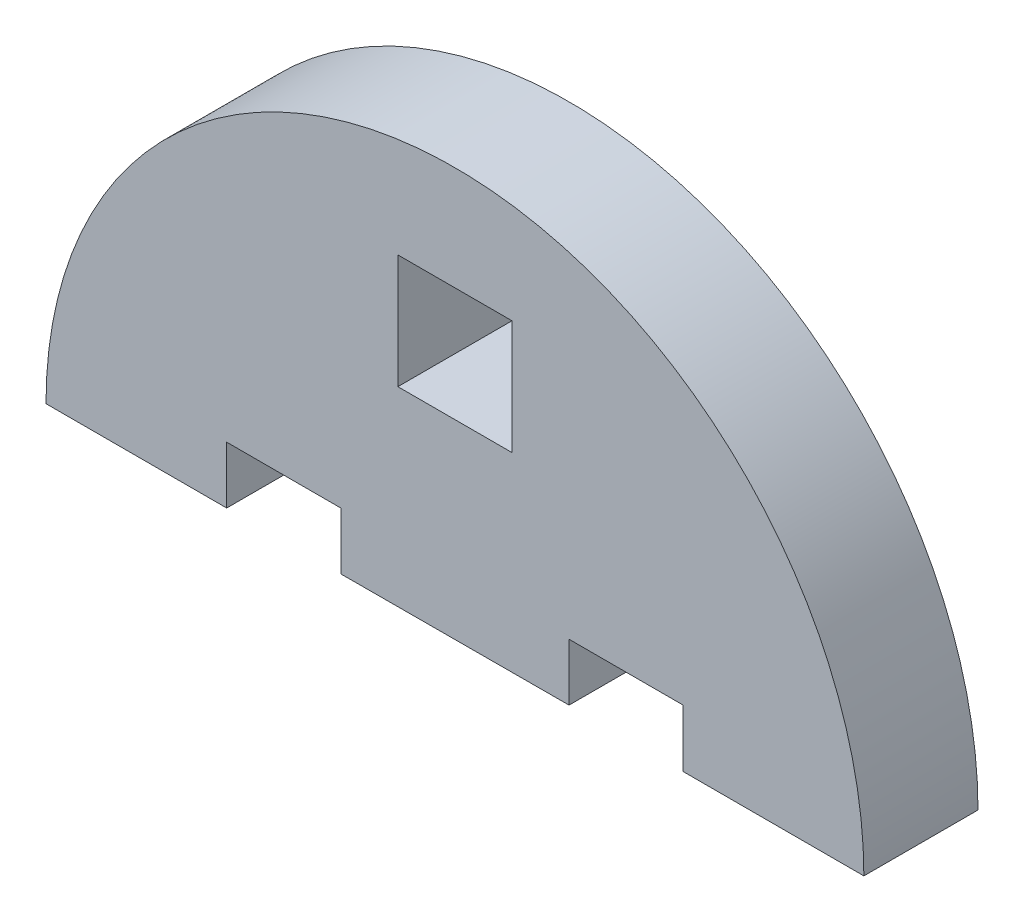
ISO-10303-21;
HEADER;
FILE_DESCRIPTION(('STEP AP214'),'2;1');
FILE_NAME('part.step','',(''),(''),'','','');
FILE_SCHEMA(('AUTOMOTIVE_DESIGN { 1 0 10303 214 1 1 1 1 }'));
ENDSEC;
DATA;
#1=APPLICATION_CONTEXT('core data for automotive mechanical design processes');
#2=APPLICATION_PROTOCOL_DEFINITION('international standard','automotive_design',2000,#1);
#3=PRODUCT_CONTEXT('',#1,'mechanical');
#4=PRODUCT('Part','Part','',(#3));
#5=PRODUCT_RELATED_PRODUCT_CATEGORY('part','',(#4));
#6=PRODUCT_DEFINITION_FORMATION('','',#4);
#7=PRODUCT_DEFINITION_CONTEXT('part definition',#1,'design');
#8=PRODUCT_DEFINITION('design','',#6,#7);
#9=PRODUCT_DEFINITION_SHAPE('','',#8);
#10=(LENGTH_UNIT() NAMED_UNIT(*) SI_UNIT(.MILLI.,.METRE.));
#11=(NAMED_UNIT(*) PLANE_ANGLE_UNIT() SI_UNIT($,.RADIAN.));
#12=(NAMED_UNIT(*) SI_UNIT($,.STERADIAN.) SOLID_ANGLE_UNIT());
#13=UNCERTAINTY_MEASURE_WITH_UNIT(LENGTH_MEASURE(1.E-05),#10,'distance_accuracy_value','');
#14=(GEOMETRIC_REPRESENTATION_CONTEXT(3) GLOBAL_UNCERTAINTY_ASSIGNED_CONTEXT((#13)) GLOBAL_UNIT_ASSIGNED_CONTEXT((#10,
#11,#12)) REPRESENTATION_CONTEXT('',''));
#15=CARTESIAN_POINT('',(0.,0.,0.));
#16=DIRECTION('',(0.,0.,1.));
#17=DIRECTION('',(1.,0.,0.));
#18=AXIS2_PLACEMENT_3D('',#15,#16,#17);
#19=CARTESIAN_POINT('',(3904.03165644461,1073.4878930967,6.));
#20=DIRECTION('',(0.,0.,1.));
#21=DIRECTION('',(1.,0.,0.));
#22=AXIS2_PLACEMENT_3D('',#19,#20,#21);
#23=PLANE('',#22);
#24=DIRECTION('',(-1.,0.,0.));
#25=VECTOR('',#24,1.);
#26=CARTESIAN_POINT('',(3925.5316564446,1073.4878930967,6.));
#27=LINE('',#26,#25);
#28=CARTESIAN_POINT('',(3925.5316564446,1073.4878930967,6.));
#29=VERTEX_POINT('',#28);
#30=CARTESIAN_POINT('',(3916.03165644461,1073.4878930967,6.));
#31=VERTEX_POINT('',#30);
#32=EDGE_CURVE('E232',#29,#31,#27,.T.);
#33=ORIENTED_EDGE('',*,*,#32,.F.);
#34=CARTESIAN_POINT('',(3904.03165644461,1073.4878930967,6.));
#35=DIRECTION('',(0.,0.,1.));
#36=DIRECTION('',(1.,0.,0.));
#37=AXIS2_PLACEMENT_3D('',#34,#35,#36);
#38=CIRCLE('',#37,21.499999999989);
#39=CARTESIAN_POINT('',(3882.53165644463,1073.4878930967,6.));
#40=VERTEX_POINT('',#39);
#41=EDGE_CURVE('E262',#29,#40,#38,.T.);
#42=ORIENTED_EDGE('',*,*,#41,.T.);
#43=DIRECTION('',(-1.,0.,0.));
#44=VECTOR('',#43,1.);
#45=CARTESIAN_POINT('',(3892.03165644461,1073.4878930967,6.));
#46=LINE('',#45,#44);
#47=CARTESIAN_POINT('',(3892.03165644461,1073.4878930967,6.));
#48=VERTEX_POINT('',#47);
#49=EDGE_CURVE('E258',#48,#40,#46,.T.);
#50=ORIENTED_EDGE('',*,*,#49,.F.);
#51=DIRECTION('',(0.,1.,0.));
#52=VECTOR('',#51,1.);
#53=CARTESIAN_POINT('',(3892.03165644461,1073.4878930967,6.));
#54=LINE('',#53,#52);
#55=CARTESIAN_POINT('',(3892.03165644461,1076.4878930967,6.));
#56=VERTEX_POINT('',#55);
#57=EDGE_CURVE('E255',#48,#56,#54,.T.);
#58=ORIENTED_EDGE('',*,*,#57,.T.);
#59=DIRECTION('',(1.,0.,0.));
#60=VECTOR('',#59,1.);
#61=CARTESIAN_POINT('',(3892.03165644461,1076.4878930967,6.));
#62=LINE('',#61,#60);
#63=CARTESIAN_POINT('',(3898.03165644461,1076.4878930967,6.));
#64=VERTEX_POINT('',#63);
#65=EDGE_CURVE('E252',#56,#64,#62,.T.);
#66=ORIENTED_EDGE('',*,*,#65,.T.);
#67=DIRECTION('',(0.,-1.,0.));
#68=VECTOR('',#67,1.);
#69=CARTESIAN_POINT('',(3898.03165644461,1076.4878930967,6.));
#70=LINE('',#69,#68);
#71=CARTESIAN_POINT('',(3898.03165644461,1073.4878930967,6.));
#72=VERTEX_POINT('',#71);
#73=EDGE_CURVE('E249',#64,#72,#70,.T.);
#74=ORIENTED_EDGE('',*,*,#73,.T.);
#75=DIRECTION('',(0.99999765231312,0.00216687984161648,0.));
#76=VECTOR('',#75,1.);
#77=CARTESIAN_POINT('',(3898.03165644461,1073.4878930967,6.));
#78=LINE('',#77,#76);
#79=CARTESIAN_POINT('',(3910.0316001002,1073.51389559376,6.));
#80=VERTEX_POINT('',#79);
#81=EDGE_CURVE('E246',#72,#80,#78,.T.);
#82=ORIENTED_EDGE('',*,*,#81,.T.);
#83=DIRECTION('',(0.,1.,0.));
#84=VECTOR('',#83,1.);
#85=CARTESIAN_POINT('',(3910.0316001002,1073.51389559376,6.));
#86=LINE('',#85,#84);
#87=CARTESIAN_POINT('',(3910.0316001002,1076.51389559376,6.));
#88=VERTEX_POINT('',#87);
#89=EDGE_CURVE('E243',#80,#88,#86,.T.);
#90=ORIENTED_EDGE('',*,*,#89,.T.);
#91=DIRECTION('',(1.,0.,0.));
#92=VECTOR('',#91,1.);
#93=CARTESIAN_POINT('',(3910.0316001002,1076.51389559376,6.));
#94=LINE('',#93,#92);
#95=CARTESIAN_POINT('',(3916.0316001002,1076.51389559376,6.));
#96=VERTEX_POINT('',#95);
#97=EDGE_CURVE('E240',#88,#96,#94,.T.);
#98=ORIENTED_EDGE('',*,*,#97,.T.);
#99=DIRECTION('',(1.86200834115068E-05,-0.999999999826646,0.));
#100=VECTOR('',#99,1.);
#101=CARTESIAN_POINT('',(3916.0316001002,1076.51389559376,6.));
#102=LINE('',#101,#100);
#103=EDGE_CURVE('E236',#96,#31,#102,.T.);
#104=ORIENTED_EDGE('',*,*,#103,.T.);
#105=EDGE_LOOP('',(#33,#42,#50,#58,#66,#74,#82,#90,#98,#104));
#106=FACE_BOUND('',#105,.T.);
#107=DIRECTION('',(0.,1.,0.));
#108=VECTOR('',#107,1.);
#109=CARTESIAN_POINT('',(3907.0316001002,0.,6.));
#110=LINE('',#109,#108);
#111=CARTESIAN_POINT('',(3907.0316001002,1083.51389559376,6.));
#112=VERTEX_POINT('',#111);
#113=CARTESIAN_POINT('',(3907.0316001002,1089.51389559376,6.));
#114=VERTEX_POINT('',#113);
#115=EDGE_CURVE('E193',#112,#114,#110,.T.);
#116=ORIENTED_EDGE('',*,*,#115,.F.);
#117=DIRECTION('',(1.,0.,0.));
#118=VECTOR('',#117,1.);
#119=CARTESIAN_POINT('',(0.,1083.51389559376,6.));
#120=LINE('',#119,#118);
#121=CARTESIAN_POINT('',(3901.0316001002,1083.51389559376,6.));
#122=VERTEX_POINT('',#121);
#123=EDGE_CURVE('E184',#122,#112,#120,.T.);
#124=ORIENTED_EDGE('',*,*,#123,.F.);
#125=DIRECTION('',(0.,-1.,0.));
#126=VECTOR('',#125,1.);
#127=CARTESIAN_POINT('',(3901.0316001002,0.,6.));
#128=LINE('',#127,#126);
#129=CARTESIAN_POINT('',(3901.0316001002,1089.51389559376,6.));
#130=VERTEX_POINT('',#129);
#131=EDGE_CURVE('E210',#130,#122,#128,.T.);
#132=ORIENTED_EDGE('',*,*,#131,.F.);
#133=DIRECTION('',(-1.,0.,0.));
#134=VECTOR('',#133,1.);
#135=CARTESIAN_POINT('',(0.,1089.51389559376,6.));
#136=LINE('',#135,#134);
#137=EDGE_CURVE('E206',#114,#130,#136,.T.);
#138=ORIENTED_EDGE('',*,*,#137,.F.);
#139=EDGE_LOOP('',(#116,#124,#132,#138));
#140=FACE_BOUND('',#139,.T.);
#141=ADVANCED_FACE('F81',(#106,#140),#23,.T.);
#142=CARTESIAN_POINT('',(3904.03165644461,1073.4878930967,0.));
#143=DIRECTION('',(0.,0.,1.));
#144=DIRECTION('',(1.,0.,0.));
#145=AXIS2_PLACEMENT_3D('',#142,#143,#144);
#146=PLANE('',#145);
#147=DIRECTION('',(-1.,0.,0.));
#148=VECTOR('',#147,1.);
#149=CARTESIAN_POINT('',(3925.5316564446,1073.4878930967,0.));
#150=LINE('',#149,#148);
#151=CARTESIAN_POINT('',(3925.5316564446,1073.4878930967,0.));
#152=VERTEX_POINT('',#151);
#153=CARTESIAN_POINT('',(3916.03165644461,1073.4878930967,0.));
#154=VERTEX_POINT('',#153);
#155=EDGE_CURVE('E202',#152,#154,#150,.T.);
#156=ORIENTED_EDGE('',*,*,#155,.T.);
#157=DIRECTION('',(1.86200834115068E-05,-0.999999999826646,0.));
#158=VECTOR('',#157,1.);
#159=CARTESIAN_POINT('',(3916.0316001002,1076.51389559376,0.));
#160=LINE('',#159,#158);
#161=CARTESIAN_POINT('',(3916.0316001002,1076.51389559376,0.));
#162=VERTEX_POINT('',#161);
#163=EDGE_CURVE('E268',#162,#154,#160,.T.);
#164=ORIENTED_EDGE('',*,*,#163,.F.);
#165=DIRECTION('',(1.,0.,0.));
#166=VECTOR('',#165,1.);
#167=CARTESIAN_POINT('',(3910.0316001002,1076.51389559376,0.));
#168=LINE('',#167,#166);
#169=CARTESIAN_POINT('',(3910.0316001002,1076.51389559376,0.));
#170=VERTEX_POINT('',#169);
#171=EDGE_CURVE('E272',#170,#162,#168,.T.);
#172=ORIENTED_EDGE('',*,*,#171,.F.);
#173=DIRECTION('',(0.,1.,0.));
#174=VECTOR('',#173,1.);
#175=CARTESIAN_POINT('',(3910.0316001002,1073.51389559376,0.));
#176=LINE('',#175,#174);
#177=CARTESIAN_POINT('',(3910.0316001002,1073.51389559376,0.));
#178=VERTEX_POINT('',#177);
#179=EDGE_CURVE('E275',#178,#170,#176,.T.);
#180=ORIENTED_EDGE('',*,*,#179,.F.);
#181=DIRECTION('',(0.99999765231312,0.00216687984161648,0.));
#182=VECTOR('',#181,1.);
#183=CARTESIAN_POINT('',(3898.03165644461,1073.4878930967,0.));
#184=LINE('',#183,#182);
#185=CARTESIAN_POINT('',(3898.03165644461,1073.4878930967,0.));
#186=VERTEX_POINT('',#185);
#187=EDGE_CURVE('E278',#186,#178,#184,.T.);
#188=ORIENTED_EDGE('',*,*,#187,.F.);
#189=DIRECTION('',(0.,-1.,0.));
#190=VECTOR('',#189,1.);
#191=CARTESIAN_POINT('',(3898.03165644461,1076.4878930967,0.));
#192=LINE('',#191,#190);
#193=CARTESIAN_POINT('',(3898.03165644461,1076.4878930967,0.));
#194=VERTEX_POINT('',#193);
#195=EDGE_CURVE('E281',#194,#186,#192,.T.);
#196=ORIENTED_EDGE('',*,*,#195,.F.);
#197=DIRECTION('',(1.,0.,0.));
#198=VECTOR('',#197,1.);
#199=CARTESIAN_POINT('',(3892.03165644461,1076.4878930967,0.));
#200=LINE('',#199,#198);
#201=CARTESIAN_POINT('',(3892.03165644461,1076.4878930967,0.));
#202=VERTEX_POINT('',#201);
#203=EDGE_CURVE('E284',#202,#194,#200,.T.);
#204=ORIENTED_EDGE('',*,*,#203,.F.);
#205=DIRECTION('',(0.,1.,0.));
#206=VECTOR('',#205,1.);
#207=CARTESIAN_POINT('',(3892.03165644461,1073.4878930967,0.));
#208=LINE('',#207,#206);
#209=CARTESIAN_POINT('',(3892.03165644461,1073.4878930967,0.));
#210=VERTEX_POINT('',#209);
#211=EDGE_CURVE('E287',#210,#202,#208,.T.);
#212=ORIENTED_EDGE('',*,*,#211,.F.);
#213=DIRECTION('',(-1.,0.,0.));
#214=VECTOR('',#213,1.);
#215=CARTESIAN_POINT('',(3892.03165644461,1073.4878930967,0.));
#216=LINE('',#215,#214);
#217=CARTESIAN_POINT('',(3882.53165644463,1073.4878930967,0.));
#218=VERTEX_POINT('',#217);
#219=EDGE_CURVE('E290',#210,#218,#216,.T.);
#220=ORIENTED_EDGE('',*,*,#219,.T.);
#221=CARTESIAN_POINT('',(3904.03165644461,1073.4878930967,0.));
#222=DIRECTION('',(0.,0.,1.));
#223=DIRECTION('',(1.,0.,0.));
#224=AXIS2_PLACEMENT_3D('',#221,#222,#223);
#225=CIRCLE('',#224,21.499999999989);
#226=EDGE_CURVE('E237',#152,#218,#225,.T.);
#227=ORIENTED_EDGE('',*,*,#226,.F.);
#228=EDGE_LOOP('',(#156,#164,#172,#180,#188,#196,#204,#212,#220,#227));
#229=FACE_BOUND('',#228,.T.);
#230=DIRECTION('',(1.,0.,0.));
#231=VECTOR('',#230,1.);
#232=CARTESIAN_POINT('',(0.,1083.51389559376,0.));
#233=LINE('',#232,#231);
#234=CARTESIAN_POINT('',(3901.0316001002,1083.51389559376,0.));
#235=VERTEX_POINT('',#234);
#236=CARTESIAN_POINT('',(3907.0316001002,1083.51389559376,0.));
#237=VERTEX_POINT('',#236);
#238=EDGE_CURVE('E107',#235,#237,#233,.T.);
#239=ORIENTED_EDGE('',*,*,#238,.T.);
#240=DIRECTION('',(0.,1.,0.));
#241=VECTOR('',#240,1.);
#242=CARTESIAN_POINT('',(3907.0316001002,0.,0.));
#243=LINE('',#242,#241);
#244=CARTESIAN_POINT('',(3907.0316001002,1089.51389559376,0.));
#245=VERTEX_POINT('',#244);
#246=EDGE_CURVE('E200',#237,#245,#243,.T.);
#247=ORIENTED_EDGE('',*,*,#246,.T.);
#248=DIRECTION('',(-1.,0.,0.));
#249=VECTOR('',#248,1.);
#250=CARTESIAN_POINT('',(0.,1089.51389559376,0.));
#251=LINE('',#250,#249);
#252=CARTESIAN_POINT('',(3901.0316001002,1089.51389559376,0.));
#253=VERTEX_POINT('',#252);
#254=EDGE_CURVE('E219',#245,#253,#251,.T.);
#255=ORIENTED_EDGE('',*,*,#254,.T.);
#256=DIRECTION('',(0.,-1.,0.));
#257=VECTOR('',#256,1.);
#258=CARTESIAN_POINT('',(3901.0316001002,0.,0.));
#259=LINE('',#258,#257);
#260=EDGE_CURVE('E194',#253,#235,#259,.T.);
#261=ORIENTED_EDGE('',*,*,#260,.T.);
#262=EDGE_LOOP('',(#239,#247,#255,#261));
#263=FACE_BOUND('',#262,.T.);
#264=ADVANCED_FACE('F337',(#229,#263),#146,.F.);
#265=CARTESIAN_POINT('',(3925.5316564446,1073.4878930967,6.));
#266=DIRECTION('',(0.,-1.,0.));
#267=DIRECTION('',(1.,0.,0.));
#268=AXIS2_PLACEMENT_3D('',#265,#266,#267);
#269=PLANE('',#268);
#270=ORIENTED_EDGE('',*,*,#155,.F.);
#271=DIRECTION('',(0.,0.,-1.));
#272=VECTOR('',#271,1.);
#273=CARTESIAN_POINT('',(3925.5316564446,1073.4878930967,6.));
#274=LINE('',#273,#272);
#275=EDGE_CURVE('E12',#29,#152,#274,.T.);
#276=ORIENTED_EDGE('',*,*,#275,.F.);
#277=ORIENTED_EDGE('',*,*,#32,.T.);
#278=DIRECTION('',(0.,0.,-1.));
#279=VECTOR('',#278,1.);
#280=CARTESIAN_POINT('',(3916.03165644461,1073.4878930967,6.));
#281=LINE('',#280,#279);
#282=EDGE_CURVE('E85',#31,#154,#281,.T.);
#283=ORIENTED_EDGE('',*,*,#282,.T.);
#284=EDGE_LOOP('',(#270,#276,#277,#283));
#285=FACE_BOUND('',#284,.T.);
#286=ADVANCED_FACE('F83',(#285),#269,.T.);
#287=CARTESIAN_POINT('',(3904.03165644461,1073.4878930967,6.));
#288=DIRECTION('',(0.,0.,-1.));
#289=DIRECTION('',(-1.,0.,0.));
#290=AXIS2_PLACEMENT_3D('',#287,#288,#289);
#291=CYLINDRICAL_SURFACE('',#290,21.499999999989);
#292=ORIENTED_EDGE('',*,*,#226,.T.);
#293=DIRECTION('',(0.,0.,-1.));
#294=VECTOR('',#293,1.);
#295=CARTESIAN_POINT('',(3882.53165644463,1073.4878930967,6.));
#296=LINE('',#295,#294);
#297=EDGE_CURVE('E91',#40,#218,#296,.T.);
#298=ORIENTED_EDGE('',*,*,#297,.F.);
#299=ORIENTED_EDGE('',*,*,#41,.F.);
#300=ORIENTED_EDGE('',*,*,#275,.T.);
#301=EDGE_LOOP('',(#292,#298,#299,#300));
#302=FACE_BOUND('',#301,.T.);
#303=ADVANCED_FACE('F343',(#302),#291,.T.);
#304=CARTESIAN_POINT('',(3892.03165644461,1073.4878930967,6.));
#305=DIRECTION('',(0.,-1.,0.));
#306=DIRECTION('',(0.,0.,-1.));
#307=AXIS2_PLACEMENT_3D('',#304,#305,#306);
#308=PLANE('',#307);
#309=ORIENTED_EDGE('',*,*,#219,.F.);
#310=DIRECTION('',(0.,0.,-1.));
#311=VECTOR('',#310,1.);
#312=CARTESIAN_POINT('',(3892.03165644461,1073.4878930967,6.));
#313=LINE('',#312,#311);
#314=EDGE_CURVE('E299',#48,#210,#313,.T.);
#315=ORIENTED_EDGE('',*,*,#314,.F.);
#316=ORIENTED_EDGE('',*,*,#49,.T.);
#317=ORIENTED_EDGE('',*,*,#297,.T.);
#318=EDGE_LOOP('',(#309,#315,#316,#317));
#319=FACE_BOUND('',#318,.T.);
#320=ADVANCED_FACE('F375',(#319),#308,.T.);
#321=CARTESIAN_POINT('',(3892.03165644461,1073.4878930967,6.));
#322=DIRECTION('',(-1.,0.,0.));
#323=DIRECTION('',(0.,0.,1.));
#324=AXIS2_PLACEMENT_3D('',#321,#322,#323);
#325=PLANE('',#324);
#326=ORIENTED_EDGE('',*,*,#211,.T.);
#327=DIRECTION('',(0.,0.,-1.));
#328=VECTOR('',#327,1.);
#329=CARTESIAN_POINT('',(3892.03165644461,1076.4878930967,6.));
#330=LINE('',#329,#328);
#331=EDGE_CURVE('E302',#56,#202,#330,.T.);
#332=ORIENTED_EDGE('',*,*,#331,.F.);
#333=ORIENTED_EDGE('',*,*,#57,.F.);
#334=ORIENTED_EDGE('',*,*,#314,.T.);
#335=EDGE_LOOP('',(#326,#332,#333,#334));
#336=FACE_BOUND('',#335,.T.);
#337=ADVANCED_FACE('F373',(#336),#325,.F.);
#338=CARTESIAN_POINT('',(3892.03165644461,1076.4878930967,6.));
#339=DIRECTION('',(0.,1.,0.));
#340=DIRECTION('',(0.,0.,1.));
#341=AXIS2_PLACEMENT_3D('',#338,#339,#340);
#342=PLANE('',#341);
#343=ORIENTED_EDGE('',*,*,#203,.T.);
#344=DIRECTION('',(0.,0.,-1.));
#345=VECTOR('',#344,1.);
#346=CARTESIAN_POINT('',(3898.03165644461,1076.4878930967,6.));
#347=LINE('',#346,#345);
#348=EDGE_CURVE('E306',#64,#194,#347,.T.);
#349=ORIENTED_EDGE('',*,*,#348,.F.);
#350=ORIENTED_EDGE('',*,*,#65,.F.);
#351=ORIENTED_EDGE('',*,*,#331,.T.);
#352=EDGE_LOOP('',(#343,#349,#350,#351));
#353=FACE_BOUND('',#352,.T.);
#354=ADVANCED_FACE('F368',(#353),#342,.F.);
#355=CARTESIAN_POINT('',(3898.03165644461,1076.4878930967,6.));
#356=DIRECTION('',(1.,0.,0.));
#357=DIRECTION('',(0.,0.,-1.));
#358=AXIS2_PLACEMENT_3D('',#355,#356,#357);
#359=PLANE('',#358);
#360=ORIENTED_EDGE('',*,*,#195,.T.);
#361=DIRECTION('',(0.,0.,-1.));
#362=VECTOR('',#361,1.);
#363=CARTESIAN_POINT('',(3898.03165644461,1073.4878930967,6.));
#364=LINE('',#363,#362);
#365=EDGE_CURVE('E310',#72,#186,#364,.T.);
#366=ORIENTED_EDGE('',*,*,#365,.F.);
#367=ORIENTED_EDGE('',*,*,#73,.F.);
#368=ORIENTED_EDGE('',*,*,#348,.T.);
#369=EDGE_LOOP('',(#360,#366,#367,#368));
#370=FACE_BOUND('',#369,.T.);
#371=ADVANCED_FACE('F364',(#370),#359,.F.);
#372=CARTESIAN_POINT('',(3898.03165644461,1073.4878930967,6.));
#373=DIRECTION('',(-0.00216687984161648,0.99999765231312,0.));
#374=DIRECTION('',(-0.99999765231312,-0.00216687984161648,0.));
#375=AXIS2_PLACEMENT_3D('',#372,#373,#374);
#376=PLANE('',#375);
#377=ORIENTED_EDGE('',*,*,#187,.T.);
#378=DIRECTION('',(0.,0.,-1.));
#379=VECTOR('',#378,1.);
#380=CARTESIAN_POINT('',(3910.0316001002,1073.51389559376,6.));
#381=LINE('',#380,#379);
#382=EDGE_CURVE('E314',#80,#178,#381,.T.);
#383=ORIENTED_EDGE('',*,*,#382,.F.);
#384=ORIENTED_EDGE('',*,*,#81,.F.);
#385=ORIENTED_EDGE('',*,*,#365,.T.);
#386=EDGE_LOOP('',(#377,#383,#384,#385));
#387=FACE_BOUND('',#386,.T.);
#388=ADVANCED_FACE('F360',(#387),#376,.F.);
#389=CARTESIAN_POINT('',(3910.0316001002,1073.51389559376,6.));
#390=DIRECTION('',(-1.,0.,0.));
#391=DIRECTION('',(0.,0.,1.));
#392=AXIS2_PLACEMENT_3D('',#389,#390,#391);
#393=PLANE('',#392);
#394=ORIENTED_EDGE('',*,*,#179,.T.);
#395=DIRECTION('',(0.,0.,-1.));
#396=VECTOR('',#395,1.);
#397=CARTESIAN_POINT('',(3910.0316001002,1076.51389559376,6.));
#398=LINE('',#397,#396);
#399=EDGE_CURVE('E318',#88,#170,#398,.T.);
#400=ORIENTED_EDGE('',*,*,#399,.F.);
#401=ORIENTED_EDGE('',*,*,#89,.F.);
#402=ORIENTED_EDGE('',*,*,#382,.T.);
#403=EDGE_LOOP('',(#394,#400,#401,#402));
#404=FACE_BOUND('',#403,.T.);
#405=ADVANCED_FACE('F356',(#404),#393,.F.);
#406=CARTESIAN_POINT('',(3910.0316001002,1076.51389559376,6.));
#407=DIRECTION('',(0.,1.,0.));
#408=DIRECTION('',(0.,0.,1.));
#409=AXIS2_PLACEMENT_3D('',#406,#407,#408);
#410=PLANE('',#409);
#411=ORIENTED_EDGE('',*,*,#171,.T.);
#412=DIRECTION('',(0.,0.,-1.));
#413=VECTOR('',#412,1.);
#414=CARTESIAN_POINT('',(3916.0316001002,1076.51389559376,6.));
#415=LINE('',#414,#413);
#416=EDGE_CURVE('E321',#96,#162,#415,.T.);
#417=ORIENTED_EDGE('',*,*,#416,.F.);
#418=ORIENTED_EDGE('',*,*,#97,.F.);
#419=ORIENTED_EDGE('',*,*,#399,.T.);
#420=EDGE_LOOP('',(#411,#417,#418,#419));
#421=FACE_BOUND('',#420,.T.);
#422=ADVANCED_FACE('F351',(#421),#410,.F.);
#423=CARTESIAN_POINT('',(3916.0316001002,1076.51389559376,6.));
#424=DIRECTION('',(0.999999999826646,1.86200834115068E-05,0.));
#425=DIRECTION('',(-1.86200834115068E-05,0.999999999826646,0.));
#426=AXIS2_PLACEMENT_3D('',#423,#424,#425);
#427=PLANE('',#426);
#428=ORIENTED_EDGE('',*,*,#163,.T.);
#429=ORIENTED_EDGE('',*,*,#282,.F.);
#430=ORIENTED_EDGE('',*,*,#103,.F.);
#431=ORIENTED_EDGE('',*,*,#416,.T.);
#432=EDGE_LOOP('',(#428,#429,#430,#431));
#433=FACE_BOUND('',#432,.T.);
#434=ADVANCED_FACE('F333',(#433),#427,.F.);
#435=CARTESIAN_POINT('',(0.,1083.51389559376,6.));
#436=DIRECTION('',(0.,1.,0.));
#437=DIRECTION('',(0.,0.,1.));
#438=AXIS2_PLACEMENT_3D('',#435,#436,#437);
#439=PLANE('',#438);
#440=ORIENTED_EDGE('',*,*,#238,.F.);
#441=DIRECTION('',(0.,0.,-1.));
#442=VECTOR('',#441,1.);
#443=CARTESIAN_POINT('',(3901.0316001002,1083.51389559376,6.));
#444=LINE('',#443,#442);
#445=EDGE_CURVE('E188',#122,#235,#444,.T.);
#446=ORIENTED_EDGE('',*,*,#445,.F.);
#447=ORIENTED_EDGE('',*,*,#123,.T.);
#448=DIRECTION('',(0.,0.,-1.));
#449=VECTOR('',#448,1.);
#450=CARTESIAN_POINT('',(3907.0316001002,1083.51389559376,6.));
#451=LINE('',#450,#449);
#452=EDGE_CURVE('E187',#112,#237,#451,.T.);
#453=ORIENTED_EDGE('',*,*,#452,.T.);
#454=EDGE_LOOP('',(#440,#446,#447,#453));
#455=FACE_BOUND('',#454,.T.);
#456=ADVANCED_FACE('F186',(#455),#439,.T.);
#457=CARTESIAN_POINT('',(3907.0316001002,0.,6.));
#458=DIRECTION('',(-1.,0.,0.));
#459=DIRECTION('',(0.,0.,1.));
#460=AXIS2_PLACEMENT_3D('',#457,#458,#459);
#461=PLANE('',#460);
#462=ORIENTED_EDGE('',*,*,#246,.F.);
#463=ORIENTED_EDGE('',*,*,#452,.F.);
#464=ORIENTED_EDGE('',*,*,#115,.T.);
#465=DIRECTION('',(0.,0.,-1.));
#466=VECTOR('',#465,1.);
#467=CARTESIAN_POINT('',(3907.0316001002,1089.51389559376,6.));
#468=LINE('',#467,#466);
#469=EDGE_CURVE('E203',#114,#245,#468,.T.);
#470=ORIENTED_EDGE('',*,*,#469,.T.);
#471=EDGE_LOOP('',(#462,#463,#464,#470));
#472=FACE_BOUND('',#471,.T.);
#473=ADVANCED_FACE('F197',(#472),#461,.T.);
#474=CARTESIAN_POINT('',(0.,1089.51389559376,6.));
#475=DIRECTION('',(0.,-1.,0.));
#476=DIRECTION('',(0.,0.,-1.));
#477=AXIS2_PLACEMENT_3D('',#474,#475,#476);
#478=PLANE('',#477);
#479=ORIENTED_EDGE('',*,*,#254,.F.);
#480=ORIENTED_EDGE('',*,*,#469,.F.);
#481=ORIENTED_EDGE('',*,*,#137,.T.);
#482=DIRECTION('',(0.,0.,-1.));
#483=VECTOR('',#482,1.);
#484=CARTESIAN_POINT('',(3901.0316001002,1089.51389559376,6.));
#485=LINE('',#484,#483);
#486=EDGE_CURVE('E99',#130,#253,#485,.T.);
#487=ORIENTED_EDGE('',*,*,#486,.T.);
#488=EDGE_LOOP('',(#479,#480,#481,#487));
#489=FACE_BOUND('',#488,.T.);
#490=ADVANCED_FACE('F395',(#489),#478,.T.);
#491=CARTESIAN_POINT('',(3901.0316001002,0.,6.));
#492=DIRECTION('',(1.,0.,0.));
#493=DIRECTION('',(0.,0.,-1.));
#494=AXIS2_PLACEMENT_3D('',#491,#492,#493);
#495=PLANE('',#494);
#496=ORIENTED_EDGE('',*,*,#260,.F.);
#497=ORIENTED_EDGE('',*,*,#486,.F.);
#498=ORIENTED_EDGE('',*,*,#131,.T.);
#499=ORIENTED_EDGE('',*,*,#445,.T.);
#500=EDGE_LOOP('',(#496,#497,#498,#499));
#501=FACE_BOUND('',#500,.T.);
#502=ADVANCED_FACE('F398',(#501),#495,.T.);
#503=CLOSED_SHELL('',(#141,#264,#286,#303,#320,#337,#354,#371,#388,#405,#422,#434,#456,#473,
#490,#502));
#504=MANIFOLD_SOLID_BREP('B2',#503);
#505=ADVANCED_BREP_SHAPE_REPRESENTATION('',(#18,#504),#14);
#506=SHAPE_DEFINITION_REPRESENTATION(#9,#505);
ENDSEC;
END-ISO-10303-21;
